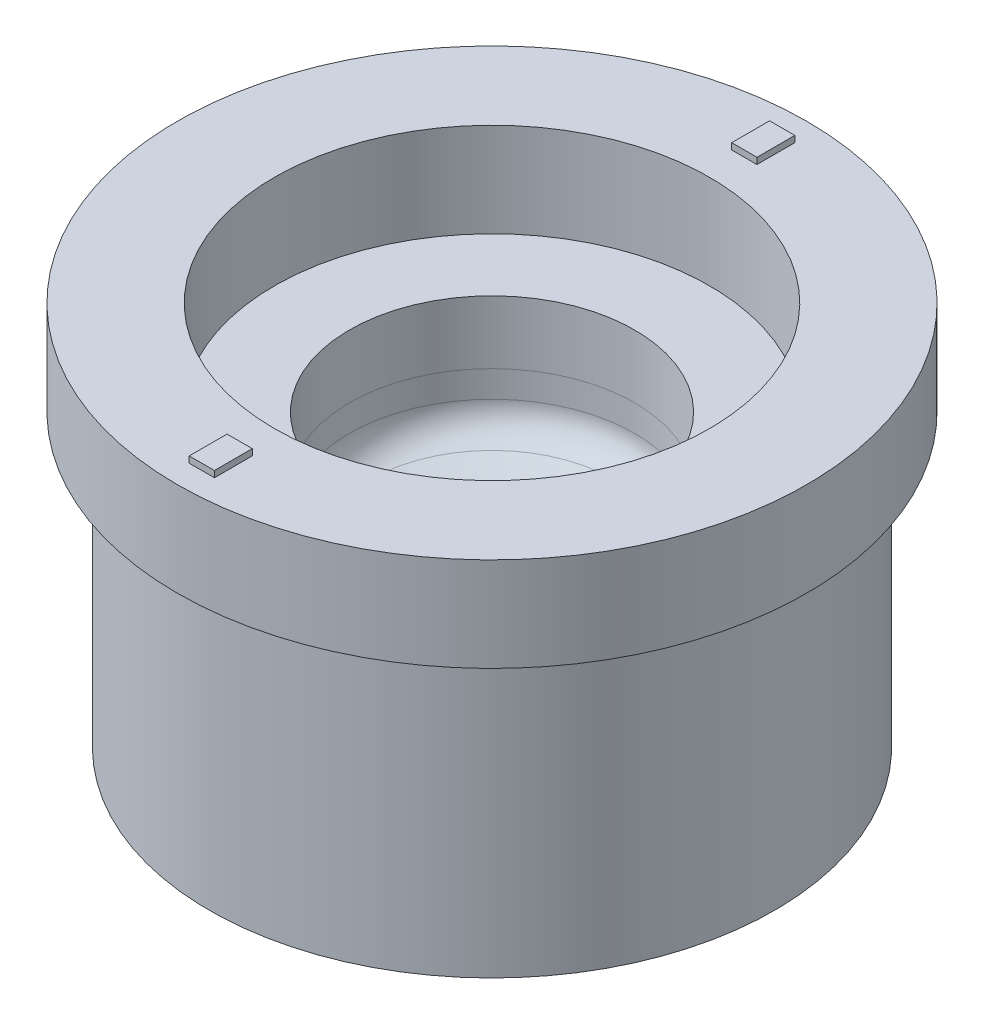
ISO-10303-21;
HEADER;
FILE_DESCRIPTION(('STEP AP214'),'2;1');
FILE_NAME('part.step','',(''),(''),'','','');
FILE_SCHEMA(('AUTOMOTIVE_DESIGN { 1 0 10303 214 1 1 1 1 }'));
ENDSEC;
DATA;
#1=APPLICATION_CONTEXT('core data for automotive mechanical design processes');
#2=APPLICATION_PROTOCOL_DEFINITION('international standard','automotive_design',2000,#1);
#3=PRODUCT_CONTEXT('',#1,'mechanical');
#4=PRODUCT('Part','Part','',(#3));
#5=PRODUCT_RELATED_PRODUCT_CATEGORY('part','',(#4));
#6=PRODUCT_DEFINITION_FORMATION('','',#4);
#7=PRODUCT_DEFINITION_CONTEXT('part definition',#1,'design');
#8=PRODUCT_DEFINITION('design','',#6,#7);
#9=PRODUCT_DEFINITION_SHAPE('','',#8);
#10=(LENGTH_UNIT() NAMED_UNIT(*) SI_UNIT(.MILLI.,.METRE.));
#11=(NAMED_UNIT(*) PLANE_ANGLE_UNIT() SI_UNIT($,.RADIAN.));
#12=(NAMED_UNIT(*) SI_UNIT($,.STERADIAN.) SOLID_ANGLE_UNIT());
#13=UNCERTAINTY_MEASURE_WITH_UNIT(LENGTH_MEASURE(1.E-05),#10,'distance_accuracy_value','');
#14=(GEOMETRIC_REPRESENTATION_CONTEXT(3) GLOBAL_UNCERTAINTY_ASSIGNED_CONTEXT((#13)) GLOBAL_UNIT_ASSIGNED_CONTEXT((#10,
#11,#12)) REPRESENTATION_CONTEXT('',''));
#15=CARTESIAN_POINT('',(0.,0.,0.));
#16=DIRECTION('',(0.,0.,1.));
#17=DIRECTION('',(1.,0.,0.));
#18=AXIS2_PLACEMENT_3D('',#15,#16,#17);
#19=CARTESIAN_POINT('',(0.,61.,0.));
#20=DIRECTION('',(0.,1.,0.));
#21=DIRECTION('',(0.,0.,1.));
#22=AXIS2_PLACEMENT_3D('',#19,#20,#21);
#23=PLANE('',#22);
#24=CARTESIAN_POINT('',(0.,61.,0.));
#25=DIRECTION('',(0.,1.,0.));
#26=DIRECTION('',(0.,0.,1.));
#27=AXIS2_PLACEMENT_3D('',#24,#25,#26);
#28=CIRCLE('',#27,34.5);
#29=CARTESIAN_POINT('',(0.,61.,34.5));
#30=VERTEX_POINT('',#29);
#31=EDGE_CURVE('E178',#30,#30,#28,.T.);
#32=ORIENTED_EDGE('',*,*,#31,.F.);
#33=EDGE_LOOP('',(#32));
#34=FACE_BOUND('',#33,.T.);
#35=CARTESIAN_POINT('',(0.,61.,0.));
#36=DIRECTION('',(0.,1.,0.));
#37=DIRECTION('',(0.,0.,1.));
#38=AXIS2_PLACEMENT_3D('',#35,#36,#37);
#39=CIRCLE('',#38,49.89);
#40=CARTESIAN_POINT('',(0.,61.,49.89));
#41=VERTEX_POINT('',#40);
#42=EDGE_CURVE('E181',#41,#41,#39,.T.);
#43=ORIENTED_EDGE('',*,*,#42,.T.);
#44=EDGE_LOOP('',(#43));
#45=FACE_BOUND('',#44,.T.);
#46=DIRECTION('',(1.,0.,0.));
#47=VECTOR('',#46,1.);
#48=CARTESIAN_POINT('',(-2.,61.,46.));
#49=LINE('',#48,#47);
#50=CARTESIAN_POINT('',(-2.,61.,46.));
#51=VERTEX_POINT('',#50);
#52=CARTESIAN_POINT('',(2.,61.,46.));
#53=VERTEX_POINT('',#52);
#54=EDGE_CURVE('E150',#51,#53,#49,.T.);
#55=ORIENTED_EDGE('',*,*,#54,.F.);
#56=DIRECTION('',(0.,0.,1.));
#57=VECTOR('',#56,1.);
#58=CARTESIAN_POINT('',(-2.00000000000002,61.,40.));
#59=LINE('',#58,#57);
#60=CARTESIAN_POINT('',(-2.00000000000002,61.,40.));
#61=VERTEX_POINT('',#60);
#62=EDGE_CURVE('E147',#61,#51,#59,.T.);
#63=ORIENTED_EDGE('',*,*,#62,.F.);
#64=DIRECTION('',(-1.,0.,0.));
#65=VECTOR('',#64,1.);
#66=CARTESIAN_POINT('',(-2.00000000000002,61.,40.));
#67=LINE('',#66,#65);
#68=CARTESIAN_POINT('',(2.,61.,40.));
#69=VERTEX_POINT('',#68);
#70=EDGE_CURVE('E159',#69,#61,#67,.T.);
#71=ORIENTED_EDGE('',*,*,#70,.F.);
#72=DIRECTION('',(0.,0.,-1.));
#73=VECTOR('',#72,1.);
#74=CARTESIAN_POINT('',(2.,61.,40.));
#75=LINE('',#74,#73);
#76=EDGE_CURVE('E167',#53,#69,#75,.T.);
#77=ORIENTED_EDGE('',*,*,#76,.F.);
#78=EDGE_LOOP('',(#55,#63,#71,#77));
#79=FACE_BOUND('',#78,.T.);
#80=DIRECTION('',(-1.,0.,0.));
#81=VECTOR('',#80,1.);
#82=CARTESIAN_POINT('',(2.,61.,-46.));
#83=LINE('',#82,#81);
#84=CARTESIAN_POINT('',(2.,61.,-46.));
#85=VERTEX_POINT('',#84);
#86=CARTESIAN_POINT('',(-2.,61.,-46.));
#87=VERTEX_POINT('',#86);
#88=EDGE_CURVE('E328',#85,#87,#83,.T.);
#89=ORIENTED_EDGE('',*,*,#88,.F.);
#90=DIRECTION('',(0.,0.,-1.));
#91=VECTOR('',#90,1.);
#92=CARTESIAN_POINT('',(2.00000000000001,61.,-40.));
#93=LINE('',#92,#91);
#94=CARTESIAN_POINT('',(2.00000000000001,61.,-40.));
#95=VERTEX_POINT('',#94);
#96=EDGE_CURVE('E145',#95,#85,#93,.T.);
#97=ORIENTED_EDGE('',*,*,#96,.F.);
#98=DIRECTION('',(1.,0.,0.));
#99=VECTOR('',#98,1.);
#100=CARTESIAN_POINT('',(2.00000000000001,61.,-40.));
#101=LINE('',#100,#99);
#102=CARTESIAN_POINT('',(-2.,61.,-40.));
#103=VERTEX_POINT('',#102);
#104=EDGE_CURVE('E141',#103,#95,#101,.T.);
#105=ORIENTED_EDGE('',*,*,#104,.F.);
#106=DIRECTION('',(0.,0.,1.));
#107=VECTOR('',#106,1.);
#108=CARTESIAN_POINT('',(-2.,61.,-40.));
#109=LINE('',#108,#107);
#110=EDGE_CURVE('E325',#87,#103,#109,.T.);
#111=ORIENTED_EDGE('',*,*,#110,.F.);
#112=EDGE_LOOP('',(#89,#97,#105,#111));
#113=FACE_BOUND('',#112,.T.);
#114=ADVANCED_FACE('F56',(#34,#45,#79,#113),#23,.T.);
#115=CARTESIAN_POINT('',(0.,-95.1102292535874,0.));
#116=DIRECTION('',(0.,1.,0.));
#117=DIRECTION('',(0.,0.,1.));
#118=AXIS2_PLACEMENT_3D('',#115,#116,#117);
#119=CYLINDRICAL_SURFACE('',#118,49.89);
#120=CARTESIAN_POINT('',(0.,46.1,0.));
#121=DIRECTION('',(0.,1.,0.));
#122=DIRECTION('',(0.,0.,1.));
#123=AXIS2_PLACEMENT_3D('',#120,#121,#122);
#124=CIRCLE('',#123,49.89);
#125=CARTESIAN_POINT('',(0.,46.1,49.89));
#126=VERTEX_POINT('',#125);
#127=EDGE_CURVE('E64',#126,#126,#124,.F.);
#128=ORIENTED_EDGE('',*,*,#127,.F.);
#129=EDGE_LOOP('',(#128));
#130=FACE_BOUND('',#129,.T.);
#131=ORIENTED_EDGE('',*,*,#42,.F.);
#132=EDGE_LOOP('',(#131));
#133=FACE_BOUND('',#132,.T.);
#134=ADVANCED_FACE('F58',(#130,#133),#119,.T.);
#135=CARTESIAN_POINT('',(0.,-95.1102292535874,0.));
#136=DIRECTION('',(0.,1.,0.));
#137=DIRECTION('',(0.,0.,1.));
#138=AXIS2_PLACEMENT_3D('',#135,#136,#137);
#139=CYLINDRICAL_SURFACE('',#138,34.5);
#140=CARTESIAN_POINT('',(0.,46.1,0.));
#141=DIRECTION('',(0.,1.,0.));
#142=DIRECTION('',(0.,0.,1.));
#143=AXIS2_PLACEMENT_3D('',#140,#141,#142);
#144=CIRCLE('',#143,34.5);
#145=CARTESIAN_POINT('',(0.,46.1,34.5));
#146=VERTEX_POINT('',#145);
#147=EDGE_CURVE('E14',#146,#146,#144,.F.);
#148=ORIENTED_EDGE('',*,*,#147,.T.);
#149=EDGE_LOOP('',(#148));
#150=FACE_BOUND('',#149,.T.);
#151=ORIENTED_EDGE('',*,*,#31,.T.);
#152=EDGE_LOOP('',(#151));
#153=FACE_BOUND('',#152,.T.);
#154=ADVANCED_FACE('F189',(#150,#153),#139,.F.);
#155=CARTESIAN_POINT('',(0.,46.1,0.));
#156=DIRECTION('',(0.,1.,0.));
#157=DIRECTION('',(0.,0.,1.));
#158=AXIS2_PLACEMENT_3D('',#155,#156,#157);
#159=PLANE('',#158);
#160=ORIENTED_EDGE('',*,*,#127,.T.);
#161=EDGE_LOOP('',(#160));
#162=FACE_BOUND('',#161,.T.);
#163=ORIENTED_EDGE('',*,*,#147,.F.);
#164=EDGE_LOOP('',(#163));
#165=FACE_BOUND('',#164,.T.);
#166=ADVANCED_FACE('F195',(#162,#165),#159,.F.);
#167=CARTESIAN_POINT('',(-2.00000000000002,62.,40.));
#168=DIRECTION('',(1.,0.,0.));
#169=DIRECTION('',(0.,0.,-1.));
#170=AXIS2_PLACEMENT_3D('',#167,#168,#169);
#171=PLANE('',#170);
#172=ORIENTED_EDGE('',*,*,#62,.T.);
#173=DIRECTION('',(0.,-1.,0.));
#174=VECTOR('',#173,1.);
#175=CARTESIAN_POINT('',(-2.,62.,46.));
#176=LINE('',#175,#174);
#177=CARTESIAN_POINT('',(-2.,62.,46.));
#178=VERTEX_POINT('',#177);
#179=EDGE_CURVE('E176',#178,#51,#176,.T.);
#180=ORIENTED_EDGE('',*,*,#179,.F.);
#181=DIRECTION('',(0.,0.,1.));
#182=VECTOR('',#181,1.);
#183=CARTESIAN_POINT('',(-2.00000000000002,62.,40.));
#184=LINE('',#183,#182);
#185=CARTESIAN_POINT('',(-2.00000000000002,62.,40.));
#186=VERTEX_POINT('',#185);
#187=EDGE_CURVE('E155',#186,#178,#184,.T.);
#188=ORIENTED_EDGE('',*,*,#187,.F.);
#189=DIRECTION('',(0.,-1.,0.));
#190=VECTOR('',#189,1.);
#191=CARTESIAN_POINT('',(-2.00000000000002,62.,40.));
#192=LINE('',#191,#190);
#193=EDGE_CURVE('E164',#186,#61,#192,.T.);
#194=ORIENTED_EDGE('',*,*,#193,.T.);
#195=EDGE_LOOP('',(#172,#180,#188,#194));
#196=FACE_BOUND('',#195,.T.);
#197=ADVANCED_FACE('F203',(#196),#171,.F.);
#198=CARTESIAN_POINT('',(-2.,62.,46.));
#199=DIRECTION('',(0.,0.,-1.));
#200=DIRECTION('',(-1.,0.,0.));
#201=AXIS2_PLACEMENT_3D('',#198,#199,#200);
#202=PLANE('',#201);
#203=ORIENTED_EDGE('',*,*,#54,.T.);
#204=DIRECTION('',(0.,-1.,0.));
#205=VECTOR('',#204,1.);
#206=CARTESIAN_POINT('',(2.,62.,46.));
#207=LINE('',#206,#205);
#208=CARTESIAN_POINT('',(2.,62.,46.));
#209=VERTEX_POINT('',#208);
#210=EDGE_CURVE('E173',#209,#53,#207,.T.);
#211=ORIENTED_EDGE('',*,*,#210,.F.);
#212=DIRECTION('',(1.,0.,0.));
#213=VECTOR('',#212,1.);
#214=CARTESIAN_POINT('',(-2.,62.,46.));
#215=LINE('',#214,#213);
#216=EDGE_CURVE('E158',#178,#209,#215,.T.);
#217=ORIENTED_EDGE('',*,*,#216,.F.);
#218=ORIENTED_EDGE('',*,*,#179,.T.);
#219=EDGE_LOOP('',(#203,#211,#217,#218));
#220=FACE_BOUND('',#219,.T.);
#221=ADVANCED_FACE('F211',(#220),#202,.F.);
#222=CARTESIAN_POINT('',(2.,62.,40.));
#223=DIRECTION('',(-1.,0.,0.));
#224=DIRECTION('',(0.,0.,1.));
#225=AXIS2_PLACEMENT_3D('',#222,#223,#224);
#226=PLANE('',#225);
#227=ORIENTED_EDGE('',*,*,#76,.T.);
#228=DIRECTION('',(0.,-1.,0.));
#229=VECTOR('',#228,1.);
#230=CARTESIAN_POINT('',(2.,62.,40.));
#231=LINE('',#230,#229);
#232=CARTESIAN_POINT('',(2.,62.,40.));
#233=VERTEX_POINT('',#232);
#234=EDGE_CURVE('E79',#233,#69,#231,.T.);
#235=ORIENTED_EDGE('',*,*,#234,.F.);
#236=DIRECTION('',(0.,0.,-1.));
#237=VECTOR('',#236,1.);
#238=CARTESIAN_POINT('',(2.,62.,40.));
#239=LINE('',#238,#237);
#240=EDGE_CURVE('E161',#209,#233,#239,.T.);
#241=ORIENTED_EDGE('',*,*,#240,.F.);
#242=ORIENTED_EDGE('',*,*,#210,.T.);
#243=EDGE_LOOP('',(#227,#235,#241,#242));
#244=FACE_BOUND('',#243,.T.);
#245=ADVANCED_FACE('F217',(#244),#226,.F.);
#246=CARTESIAN_POINT('',(-2.00000000000002,62.,40.));
#247=DIRECTION('',(0.,0.,1.));
#248=DIRECTION('',(1.,0.,0.));
#249=AXIS2_PLACEMENT_3D('',#246,#247,#248);
#250=PLANE('',#249);
#251=ORIENTED_EDGE('',*,*,#70,.T.);
#252=ORIENTED_EDGE('',*,*,#193,.F.);
#253=DIRECTION('',(-1.,0.,0.));
#254=VECTOR('',#253,1.);
#255=CARTESIAN_POINT('',(-2.00000000000002,62.,40.));
#256=LINE('',#255,#254);
#257=EDGE_CURVE('E163',#233,#186,#256,.T.);
#258=ORIENTED_EDGE('',*,*,#257,.F.);
#259=ORIENTED_EDGE('',*,*,#234,.T.);
#260=EDGE_LOOP('',(#251,#252,#258,#259));
#261=FACE_BOUND('',#260,.T.);
#262=ADVANCED_FACE('F221',(#261),#250,.F.);
#263=CARTESIAN_POINT('',(0.,62.,0.));
#264=DIRECTION('',(0.,1.,0.));
#265=DIRECTION('',(0.,0.,1.));
#266=AXIS2_PLACEMENT_3D('',#263,#264,#265);
#267=PLANE('',#266);
#268=ORIENTED_EDGE('',*,*,#187,.T.);
#269=ORIENTED_EDGE('',*,*,#216,.T.);
#270=ORIENTED_EDGE('',*,*,#240,.T.);
#271=ORIENTED_EDGE('',*,*,#257,.T.);
#272=EDGE_LOOP('',(#268,#269,#270,#271));
#273=FACE_BOUND('',#272,.T.);
#274=ADVANCED_FACE('F225',(#273),#267,.T.);
#275=CARTESIAN_POINT('',(2.00000000000001,62.,-40.));
#276=DIRECTION('',(-1.,0.,0.));
#277=DIRECTION('',(0.,0.,1.));
#278=AXIS2_PLACEMENT_3D('',#275,#276,#277);
#279=PLANE('',#278);
#280=ORIENTED_EDGE('',*,*,#96,.T.);
#281=DIRECTION('',(0.,-1.,0.));
#282=VECTOR('',#281,1.);
#283=CARTESIAN_POINT('',(2.,62.,-46.));
#284=LINE('',#283,#282);
#285=CARTESIAN_POINT('',(2.,62.,-46.));
#286=VERTEX_POINT('',#285);
#287=EDGE_CURVE('E126',#286,#85,#284,.T.);
#288=ORIENTED_EDGE('',*,*,#287,.F.);
#289=DIRECTION('',(0.,0.,-1.));
#290=VECTOR('',#289,1.);
#291=CARTESIAN_POINT('',(2.00000000000001,62.,-40.));
#292=LINE('',#291,#290);
#293=CARTESIAN_POINT('',(2.00000000000001,62.,-40.));
#294=VERTEX_POINT('',#293);
#295=EDGE_CURVE('E133',#294,#286,#292,.T.);
#296=ORIENTED_EDGE('',*,*,#295,.F.);
#297=DIRECTION('',(0.,-1.,0.));
#298=VECTOR('',#297,1.);
#299=CARTESIAN_POINT('',(2.00000000000001,62.,-40.));
#300=LINE('',#299,#298);
#301=EDGE_CURVE('E322',#294,#95,#300,.T.);
#302=ORIENTED_EDGE('',*,*,#301,.T.);
#303=EDGE_LOOP('',(#280,#288,#296,#302));
#304=FACE_BOUND('',#303,.T.);
#305=ADVANCED_FACE('F143',(#304),#279,.F.);
#306=CARTESIAN_POINT('',(2.,62.,-46.));
#307=DIRECTION('',(0.,0.,1.));
#308=DIRECTION('',(1.,0.,0.));
#309=AXIS2_PLACEMENT_3D('',#306,#307,#308);
#310=PLANE('',#309);
#311=ORIENTED_EDGE('',*,*,#88,.T.);
#312=DIRECTION('',(0.,-1.,0.));
#313=VECTOR('',#312,1.);
#314=CARTESIAN_POINT('',(-2.,62.,-46.));
#315=LINE('',#314,#313);
#316=CARTESIAN_POINT('',(-2.,62.,-46.));
#317=VERTEX_POINT('',#316);
#318=EDGE_CURVE('E129',#317,#87,#315,.T.);
#319=ORIENTED_EDGE('',*,*,#318,.F.);
#320=DIRECTION('',(-1.,0.,0.));
#321=VECTOR('',#320,1.);
#322=CARTESIAN_POINT('',(2.,62.,-46.));
#323=LINE('',#322,#321);
#324=EDGE_CURVE('E122',#286,#317,#323,.T.);
#325=ORIENTED_EDGE('',*,*,#324,.F.);
#326=ORIENTED_EDGE('',*,*,#287,.T.);
#327=EDGE_LOOP('',(#311,#319,#325,#326));
#328=FACE_BOUND('',#327,.T.);
#329=ADVANCED_FACE('F124',(#328),#310,.F.);
#330=CARTESIAN_POINT('',(-2.,62.,-40.));
#331=DIRECTION('',(1.,0.,0.));
#332=DIRECTION('',(0.,0.,-1.));
#333=AXIS2_PLACEMENT_3D('',#330,#331,#332);
#334=PLANE('',#333);
#335=ORIENTED_EDGE('',*,*,#110,.T.);
#336=DIRECTION('',(0.,-1.,0.));
#337=VECTOR('',#336,1.);
#338=CARTESIAN_POINT('',(-2.,62.,-40.));
#339=LINE('',#338,#337);
#340=CARTESIAN_POINT('',(-2.,62.,-40.));
#341=VERTEX_POINT('',#340);
#342=EDGE_CURVE('E71',#341,#103,#339,.T.);
#343=ORIENTED_EDGE('',*,*,#342,.F.);
#344=DIRECTION('',(0.,0.,1.));
#345=VECTOR('',#344,1.);
#346=CARTESIAN_POINT('',(-2.,62.,-40.));
#347=LINE('',#346,#345);
#348=EDGE_CURVE('E132',#317,#341,#347,.T.);
#349=ORIENTED_EDGE('',*,*,#348,.F.);
#350=ORIENTED_EDGE('',*,*,#318,.T.);
#351=EDGE_LOOP('',(#335,#343,#349,#350));
#352=FACE_BOUND('',#351,.T.);
#353=ADVANCED_FACE('F233',(#352),#334,.F.);
#354=CARTESIAN_POINT('',(2.00000000000001,62.,-40.));
#355=DIRECTION('',(0.,0.,-1.));
#356=DIRECTION('',(-1.,0.,0.));
#357=AXIS2_PLACEMENT_3D('',#354,#355,#356);
#358=PLANE('',#357);
#359=ORIENTED_EDGE('',*,*,#104,.T.);
#360=ORIENTED_EDGE('',*,*,#301,.F.);
#361=DIRECTION('',(1.,0.,0.));
#362=VECTOR('',#361,1.);
#363=CARTESIAN_POINT('',(2.00000000000001,62.,-40.));
#364=LINE('',#363,#362);
#365=EDGE_CURVE('E137',#341,#294,#364,.T.);
#366=ORIENTED_EDGE('',*,*,#365,.F.);
#367=ORIENTED_EDGE('',*,*,#342,.T.);
#368=EDGE_LOOP('',(#359,#360,#366,#367));
#369=FACE_BOUND('',#368,.T.);
#370=ADVANCED_FACE('F236',(#369),#358,.F.);
#371=CARTESIAN_POINT('',(0.,62.,0.));
#372=DIRECTION('',(0.,1.,0.));
#373=DIRECTION('',(0.,0.,-1.));
#374=AXIS2_PLACEMENT_3D('',#371,#372,#373);
#375=PLANE('',#374);
#376=ORIENTED_EDGE('',*,*,#295,.T.);
#377=ORIENTED_EDGE('',*,*,#324,.T.);
#378=ORIENTED_EDGE('',*,*,#348,.T.);
#379=ORIENTED_EDGE('',*,*,#365,.T.);
#380=EDGE_LOOP('',(#376,#377,#378,#379));
#381=FACE_BOUND('',#380,.T.);
#382=ADVANCED_FACE('F136',(#381),#375,.T.);
#383=CLOSED_SHELL('',(#114,#134,#154,#166,#197,#221,#245,#262,#274,#305,#329,#353,#370,#382));
#384=MANIFOLD_SOLID_BREP('B2',#383);
#385=CARTESIAN_POINT('',(0.,46.,0.));
#386=DIRECTION('',(0.,1.,0.));
#387=DIRECTION('',(0.,0.,1.));
#388=AXIS2_PLACEMENT_3D('',#385,#386,#387);
#389=PLANE('',#388);
#390=CARTESIAN_POINT('',(0.,46.,0.));
#391=DIRECTION('',(0.,1.,0.));
#392=DIRECTION('',(0.,0.,1.));
#393=AXIS2_PLACEMENT_3D('',#390,#391,#392);
#394=CIRCLE('',#393,37.);
#395=CARTESIAN_POINT('',(0.,46.,37.));
#396=VERTEX_POINT('',#395);
#397=EDGE_CURVE('E443',#396,#396,#394,.T.);
#398=ORIENTED_EDGE('',*,*,#397,.F.);
#399=EDGE_LOOP('',(#398));
#400=FACE_BOUND('',#399,.T.);
#401=CARTESIAN_POINT('',(0.,46.,0.));
#402=DIRECTION('',(0.,-1.,0.));
#403=DIRECTION('',(0.,0.,-1.));
#404=AXIS2_PLACEMENT_3D('',#401,#402,#403);
#405=CIRCLE('',#404,44.79);
#406=CARTESIAN_POINT('',(0.,46.,-44.79));
#407=VERTEX_POINT('',#406);
#408=EDGE_CURVE('E54',#407,#407,#405,.T.);
#409=ORIENTED_EDGE('',*,*,#408,.F.);
#410=EDGE_LOOP('',(#409));
#411=FACE_BOUND('',#410,.T.);
#412=ADVANCED_FACE('F346',(#400,#411),#389,.T.);
#413=CARTESIAN_POINT('',(0.,-20.,0.));
#414=DIRECTION('',(0.,-1.,0.));
#415=DIRECTION('',(0.,0.,-1.));
#416=AXIS2_PLACEMENT_3D('',#413,#414,#415);
#417=CYLINDRICAL_SURFACE('',#416,44.79);
#418=ORIENTED_EDGE('',*,*,#408,.T.);
#419=EDGE_LOOP('',(#418));
#420=FACE_BOUND('',#419,.T.);
#421=CARTESIAN_POINT('',(0.,0.,0.));
#422=DIRECTION('',(0.,-1.,0.));
#423=DIRECTION('',(0.,0.,-1.));
#424=AXIS2_PLACEMENT_3D('',#421,#422,#423);
#425=CIRCLE('',#424,44.79);
#426=CARTESIAN_POINT('',(0.,0.,-44.79));
#427=VERTEX_POINT('',#426);
#428=EDGE_CURVE('E355',#427,#427,#425,.T.);
#429=ORIENTED_EDGE('',*,*,#428,.F.);
#430=EDGE_LOOP('',(#429));
#431=FACE_BOUND('',#430,.T.);
#432=ADVANCED_FACE('F419',(#420,#431),#417,.T.);
#433=CARTESIAN_POINT('',(0.,0.,0.));
#434=DIRECTION('',(0.,-1.,0.));
#435=DIRECTION('',(0.,0.,-1.));
#436=AXIS2_PLACEMENT_3D('',#433,#434,#435);
#437=PLANE('',#436);
#438=ORIENTED_EDGE('',*,*,#428,.T.);
#439=EDGE_LOOP('',(#438));
#440=FACE_BOUND('',#439,.T.);
#441=ADVANCED_FACE('F412',(#440),#437,.T.);
#442=CARTESIAN_POINT('',(0.,36.,0.));
#443=DIRECTION('',(0.,1.,0.));
#444=DIRECTION('',(0.,0.,1.));
#445=AXIS2_PLACEMENT_3D('',#442,#443,#444);
#446=CYLINDRICAL_SURFACE('',#445,37.);
#447=CARTESIAN_POINT('',(0.,36.,0.));
#448=DIRECTION('',(0.,1.,0.));
#449=DIRECTION('',(0.,0.,1.));
#450=AXIS2_PLACEMENT_3D('',#447,#448,#449);
#451=CIRCLE('',#450,37.);
#452=CARTESIAN_POINT('',(0.,36.,37.));
#453=VERTEX_POINT('',#452);
#454=EDGE_CURVE('E434',#453,#453,#451,.T.);
#455=ORIENTED_EDGE('',*,*,#454,.F.);
#456=EDGE_LOOP('',(#455));
#457=FACE_BOUND('',#456,.T.);
#458=ORIENTED_EDGE('',*,*,#397,.T.);
#459=EDGE_LOOP('',(#458));
#460=FACE_BOUND('',#459,.T.);
#461=ADVANCED_FACE('F409',(#457,#460),#446,.F.);
#462=CARTESIAN_POINT('',(0.,36.,0.));
#463=DIRECTION('',(0.,1.,0.));
#464=DIRECTION('',(0.,0.,1.));
#465=AXIS2_PLACEMENT_3D('',#462,#463,#464);
#466=PLANE('',#465);
#467=CARTESIAN_POINT('',(0.,36.,0.));
#468=DIRECTION('',(0.,1.,0.));
#469=DIRECTION('',(0.,0.,1.));
#470=AXIS2_PLACEMENT_3D('',#467,#468,#469);
#471=CIRCLE('',#470,35.);
#472=CARTESIAN_POINT('',(0.,36.,35.));
#473=VERTEX_POINT('',#472);
#474=EDGE_CURVE('E385',#473,#473,#471,.T.);
#475=ORIENTED_EDGE('',*,*,#474,.F.);
#476=EDGE_LOOP('',(#475));
#477=FACE_BOUND('',#476,.T.);
#478=ORIENTED_EDGE('',*,*,#454,.T.);
#479=EDGE_LOOP('',(#478));
#480=FACE_BOUND('',#479,.T.);
#481=ADVANCED_FACE('F405',(#477,#480),#466,.T.);
#482=CARTESIAN_POINT('',(0.,36.,0.));
#483=DIRECTION('',(0.,1.,0.));
#484=DIRECTION('',(0.,0.,1.));
#485=AXIS2_PLACEMENT_3D('',#482,#483,#484);
#486=CYLINDRICAL_SURFACE('',#485,35.);
#487=ORIENTED_EDGE('',*,*,#474,.T.);
#488=EDGE_LOOP('',(#487));
#489=FACE_BOUND('',#488,.T.);
#490=CARTESIAN_POINT('',(0.,46.,0.));
#491=DIRECTION('',(0.,1.,0.));
#492=DIRECTION('',(0.,0.,1.));
#493=AXIS2_PLACEMENT_3D('',#490,#491,#492);
#494=CIRCLE('',#493,35.);
#495=CARTESIAN_POINT('',(0.,46.,35.));
#496=VERTEX_POINT('',#495);
#497=EDGE_CURVE('E438',#496,#496,#494,.T.);
#498=ORIENTED_EDGE('',*,*,#497,.F.);
#499=EDGE_LOOP('',(#498));
#500=FACE_BOUND('',#499,.T.);
#501=ADVANCED_FACE('F401',(#489,#500),#486,.T.);
#502=CARTESIAN_POINT('',(0.,36.,0.));
#503=DIRECTION('',(0.,1.,0.));
#504=DIRECTION('',(0.,0.,1.));
#505=AXIS2_PLACEMENT_3D('',#502,#503,#504);
#506=CYLINDRICAL_SURFACE('',#505,22.6);
#507=CARTESIAN_POINT('',(0.,36.,0.));
#508=DIRECTION('',(0.,1.,0.));
#509=DIRECTION('',(0.,0.,1.));
#510=AXIS2_PLACEMENT_3D('',#507,#508,#509);
#511=CIRCLE('',#510,22.60379981973);
#512=CARTESIAN_POINT('',(0.,36.,22.60379981973));
#513=VERTEX_POINT('',#512);
#514=EDGE_CURVE('E376',#513,#513,#511,.T.);
#515=ORIENTED_EDGE('',*,*,#514,.F.);
#516=EDGE_LOOP('',(#515));
#517=FACE_BOUND('',#516,.T.);
#518=CARTESIAN_POINT('',(0.,46.,0.));
#519=DIRECTION('',(0.,1.,0.));
#520=DIRECTION('',(0.,0.,1.));
#521=AXIS2_PLACEMENT_3D('',#518,#519,#520);
#522=CIRCLE('',#521,22.6);
#523=CARTESIAN_POINT('',(0.,46.,22.6));
#524=VERTEX_POINT('',#523);
#525=EDGE_CURVE('E431',#524,#524,#522,.T.);
#526=ORIENTED_EDGE('',*,*,#525,.T.);
#527=EDGE_LOOP('',(#526));
#528=FACE_BOUND('',#527,.T.);
#529=ADVANCED_FACE('F404',(#517,#528),#506,.F.);
#530=ORIENTED_EDGE('',*,*,#525,.F.);
#531=EDGE_LOOP('',(#530));
#532=FACE_BOUND('',#531,.T.);
#533=ORIENTED_EDGE('',*,*,#497,.T.);
#534=EDGE_LOOP('',(#533));
#535=FACE_BOUND('',#534,.T.);
#536=ADVANCED_FACE('F398',(#532,#535),#389,.T.);
#537=CARTESIAN_POINT('',(0.,42.3889186306577,0.));
#538=DIRECTION('',(0.,1.,0.));
#539=DIRECTION('',(0.,0.,1.));
#540=AXIS2_PLACEMENT_3D('',#537,#538,#539);
#541=CYLINDRICAL_SURFACE('',#540,22.60379981973);
#542=CARTESIAN_POINT('',(0.,31.8,0.));
#543=DIRECTION('',(0.,1.,0.));
#544=DIRECTION('',(0.,0.,1.));
#545=AXIS2_PLACEMENT_3D('',#542,#543,#544);
#546=CIRCLE('',#545,22.60379981973);
#547=CARTESIAN_POINT('',(0.,31.8,22.60379981973));
#548=VERTEX_POINT('',#547);
#549=EDGE_CURVE('E371',#548,#548,#546,.T.);
#550=ORIENTED_EDGE('',*,*,#549,.F.);
#551=EDGE_LOOP('',(#550));
#552=FACE_BOUND('',#551,.T.);
#553=ORIENTED_EDGE('',*,*,#514,.T.);
#554=EDGE_LOOP('',(#553));
#555=FACE_BOUND('',#554,.T.);
#556=ADVANCED_FACE('F387',(#552,#555),#541,.F.);
#557=CARTESIAN_POINT('',(0.,31.8,0.));
#558=DIRECTION('',(0.,1.,0.));
#559=DIRECTION('',(0.,0.,1.));
#560=AXIS2_PLACEMENT_3D('',#557,#558,#559);
#561=TOROIDAL_SURFACE('',#560,17.60379981973,5.);
#562=CARTESIAN_POINT('',(0.,27.1015368960704,0.));
#563=DIRECTION('',(0.,1.,0.));
#564=DIRECTION('',(0.,0.,1.));
#565=AXIS2_PLACEMENT_3D('',#562,#563,#564);
#566=CIRCLE('',#565,19.3139005363584);
#567=CARTESIAN_POINT('',(0.,27.1015368960704,19.3139005363584));
#568=VERTEX_POINT('',#567);
#569=EDGE_CURVE('E368',#568,#568,#566,.T.);
#570=ORIENTED_EDGE('',*,*,#569,.F.);
#571=EDGE_LOOP('',(#570));
#572=FACE_BOUND('',#571,.T.);
#573=ORIENTED_EDGE('',*,*,#549,.T.);
#574=EDGE_LOOP('',(#573));
#575=FACE_BOUND('',#574,.T.);
#576=ADVANCED_FACE('F397',(#572,#575),#561,.F.);
#577=CARTESIAN_POINT('',(0.,27.1015368960704,0.));
#578=DIRECTION('',(0.,1.,0.));
#579=DIRECTION('',(0.,0.,1.));
#580=AXIS2_PLACEMENT_3D('',#577,#578,#579);
#581=CONICAL_SURFACE('',#580,19.3139005363584,1.22173047639603);
#582=CARTESIAN_POINT('',(0.,20.5603073792141,0.));
#583=DIRECTION('',(0.,1.,0.));
#584=DIRECTION('',(0.,0.,1.));
#585=AXIS2_PLACEMENT_3D('',#582,#583,#584);
#586=CIRCLE('',#585,1.34202014332567);
#587=CARTESIAN_POINT('',(0.,20.5603073792141,1.3420201433257));
#588=VERTEX_POINT('',#587);
#589=EDGE_CURVE('E366',#588,#588,#586,.T.);
#590=CARTESIAN_POINT('',(0.,20.5603073792141,1.3420201433257));
#591=CARTESIAN_POINT('',(0.,20.6284451866814,1.52922723075312));
#592=CARTESIAN_POINT('',(0.,20.6965829941486,1.71643431818055));
#593=CARTESIAN_POINT('',(0.,20.8328586090831,2.09084849303539));
#594=CARTESIAN_POINT('',(0.,20.9009964165504,2.27805558046282));
#595=CARTESIAN_POINT('',(0.,21.0372720314849,2.65246975531767));
#596=CARTESIAN_POINT('',(0.,21.1054098389521,2.83967684274509));
#597=CARTESIAN_POINT('',(0.,21.2416854538866,3.21409101759994));
#598=CARTESIAN_POINT('',(0.,21.3098232613539,3.40129810502736));
#599=CARTESIAN_POINT('',(0.,21.4460988762884,3.77571227988221));
#600=CARTESIAN_POINT('',(0.,21.5142366837557,3.96291936730963));
#601=CARTESIAN_POINT('',(0.,21.6505122986902,4.33733354216448));
#602=CARTESIAN_POINT('',(0.,21.7186501061574,4.5245406295919));
#603=CARTESIAN_POINT('',(0.,21.8549257210919,4.89895480444675));
#604=CARTESIAN_POINT('',(0.,21.9230635285592,5.08616189187418));
#605=CARTESIAN_POINT('',(0.,22.0593391434937,5.46057606672902));
#606=CARTESIAN_POINT('',(0.,22.1274769509609,5.64778315415645));
#607=CARTESIAN_POINT('',(0.,22.2637525658954,6.02219732901129));
#608=CARTESIAN_POINT('',(0.,22.3318903733627,6.20940441643872));
#609=CARTESIAN_POINT('',(0.,22.4681659882972,6.58381859129357));
#610=CARTESIAN_POINT('',(0.,22.5363037957645,6.77102567872099));
#611=CARTESIAN_POINT('',(0.,22.672579410699,7.14543985357584));
#612=CARTESIAN_POINT('',(0.,22.7407172181662,7.33264694100326));
#613=CARTESIAN_POINT('',(0.,22.8769928331007,7.70706111585811));
#614=CARTESIAN_POINT('',(0.,22.945130640568,7.89426820328553));
#615=CARTESIAN_POINT('',(0.,23.0814062555025,8.26868237814038));
#616=CARTESIAN_POINT('',(0.,23.1495440629697,8.4558894655678));
#617=CARTESIAN_POINT('',(0.,23.2858196779043,8.83030364042265));
#618=CARTESIAN_POINT('',(0.,23.3539574853715,9.01751072785008));
#619=CARTESIAN_POINT('',(0.,23.490233100306,9.39192490270492));
#620=CARTESIAN_POINT('',(0.,23.5583709077733,9.57913199013235));
#621=CARTESIAN_POINT('',(0.,23.6946465227078,9.9535461649872));
#622=CARTESIAN_POINT('',(0.,23.762784330175,10.1407532524146));
#623=CARTESIAN_POINT('',(0.,23.8990599451095,10.5151674272695));
#624=CARTESIAN_POINT('',(0.,23.9671977525768,10.7023745146969));
#625=CARTESIAN_POINT('',(0.,24.1034733675113,11.0767886895517));
#626=CARTESIAN_POINT('',(0.,24.1716111749785,11.2639957769792));
#627=CARTESIAN_POINT('',(0.,24.307886789913,11.638409951834));
#628=CARTESIAN_POINT('',(0.,24.3760245973803,11.8256170392614));
#629=CARTESIAN_POINT('',(0.,24.5123002123148,12.2000312141163));
#630=CARTESIAN_POINT('',(0.,24.5804380197821,12.3872383015437));
#631=CARTESIAN_POINT('',(0.,24.7167136347166,12.7616524763986));
#632=CARTESIAN_POINT('',(0.,24.7848514421838,12.948859563826));
#633=CARTESIAN_POINT('',(0.,24.9211270571183,13.3232737386808));
#634=CARTESIAN_POINT('',(0.,24.9892648645856,13.5104808261082));
#635=CARTESIAN_POINT('',(0.,25.1255404795201,13.8848950009631));
#636=CARTESIAN_POINT('',(0.,25.1936782869873,14.0721020883905));
#637=CARTESIAN_POINT('',(0.,25.3299539019219,14.4465162632454));
#638=CARTESIAN_POINT('',(0.,25.3980917093891,14.6337233506728));
#639=CARTESIAN_POINT('',(0.,25.5343673243236,15.0081375255276));
#640=CARTESIAN_POINT('',(0.,25.6025051317909,15.1953446129551));
#641=CARTESIAN_POINT('',(0.,25.7387807467254,15.5697587878099));
#642=CARTESIAN_POINT('',(0.,25.8069185541926,15.7569658752373));
#643=CARTESIAN_POINT('',(0.,25.9431941691271,16.1313800500922));
#644=CARTESIAN_POINT('',(0.,26.0113319765944,16.3185871375196));
#645=CARTESIAN_POINT('',(0.,26.1476075915289,16.6930013123745));
#646=CARTESIAN_POINT('',(0.,26.2157453989962,16.8802083998019));
#647=CARTESIAN_POINT('',(0.,26.3520210139307,17.2546225746567));
#648=CARTESIAN_POINT('',(0.,26.4201588213979,17.4418296620841));
#649=CARTESIAN_POINT('',(0.,26.5564344363324,17.816243836939));
#650=CARTESIAN_POINT('',(0.,26.6245722437997,18.0034509243664));
#651=CARTESIAN_POINT('',(0.,26.7608478587342,18.3778650992213));
#652=CARTESIAN_POINT('',(0.,26.8289856662014,18.5650721866487));
#653=CARTESIAN_POINT('',(0.,26.9652612811359,18.9394863615035));
#654=CARTESIAN_POINT('',(0.,27.0333990886032,19.126693448931));
#655=CARTESIAN_POINT('',(0.,27.1015368960704,19.3139005363584));
#656=B_SPLINE_CURVE_WITH_KNOTS('',3,(#590,#591,#592,#593,#594,#595,#596,#597,#598,#599,#600,
#601,#602,#603,#604,#605,#606,#607,#608,#609,#610,#611,#612,#613,#614,#615,#616,#617,#618,#619,
#620,#621,#622,#623,#624,#625,#626,#627,#628,#629,#630,#631,#632,#633,#634,#635,#636,#637,#638,
#639,#640,#641,#642,#643,#644,#645,#646,#647,#648,#649,#650,#651,#652,#653,#654,#655),
.UNSPECIFIED.,.F.,.F.,(4,2,2,2,2,2,2,2,2,2,2,2,2,2,2,2,2,2,2,2,2,2,2,2,2,2,2,2,2,2,2,2,4),(0.,
0.597664863870658,1.19532972774132,1.79299459161197,2.39065945548263,2.98832431935329,
3.58598918322395,4.18365404709461,4.78131891096527,5.37898377483593,5.97664863870658,
6.57431350257724,7.1719783664479,7.76964323031856,8.36730809418922,8.96497295805987,
9.56263782193053,10.1603026858012,10.7579675496719,11.3556324135425,11.9532972774132,
12.5509621412838,13.1486270051545,13.7462918690251,14.3439567328958,14.9416215967665,
15.5392864606371,16.1369513245078,16.7346161883784,17.3322810522491,17.9299459161197,
18.5276107799904,19.1252756438611),.UNSPECIFIED.);
#657=EDGE_CURVE('BSEAM362',#588,#568,#656,.T.);
#658=ORIENTED_EDGE('',*,*,#589,.F.);
#659=ORIENTED_EDGE('',*,*,#569,.T.);
#660=ORIENTED_EDGE('',*,*,#657,.T.);
#661=ORIENTED_EDGE('',*,*,#657,.F.);
#662=EDGE_LOOP('',(#658,#660,#659,#661));
#663=FACE_BOUND('',#662,.T.);
#664=ADVANCED_FACE('F362',(#663),#581,.F.);
#665=CARTESIAN_POINT('',(0.,21.5,0.999999999999997));
#666=DIRECTION('',(-1.,0.,0.));
#667=DIRECTION('',(0.,0.,1.));
#668=AXIS2_PLACEMENT_3D('',#665,#666,#667);
#669=CIRCLE('',#668,1.);
#670=TRIMMED_CURVE('',#669,(PARAMETER_VALUE(-3.14159255362977)),
(PARAMETER_VALUE(3.14159255362977)),.T.,.PARAMETER.);
#671=CARTESIAN_POINT('',(0.,21.5,0.));
#672=DIRECTION('',(0.,1.,0.));
#673=AXIS1_PLACEMENT('',#671,#672);
#674=SURFACE_OF_REVOLUTION('',#670,#673);
#675=CARTESIAN_POINT('',(0.,21.5,0.));
#676=VERTEX_POINT('',#675);
#677=VERTEX_LOOP('',#676);
#678=FACE_BOUND('',#677,.T.);
#679=ORIENTED_EDGE('',*,*,#589,.T.);
#680=EDGE_LOOP('',(#679));
#681=FACE_BOUND('',#680,.T.);
#682=ADVANCED_FACE('F359',(#678,#681),#674,.F.);
#683=CLOSED_SHELL('',(#412,#432,#441,#461,#481,#501,#529,#536,#556,#576,#664,#682));
#684=MANIFOLD_SOLID_BREP('B8',#683);
#685=ADVANCED_BREP_SHAPE_REPRESENTATION('',(#18,#384,#684),#14);
#686=SHAPE_DEFINITION_REPRESENTATION(#9,#685);
ENDSEC;
END-ISO-10303-21;
